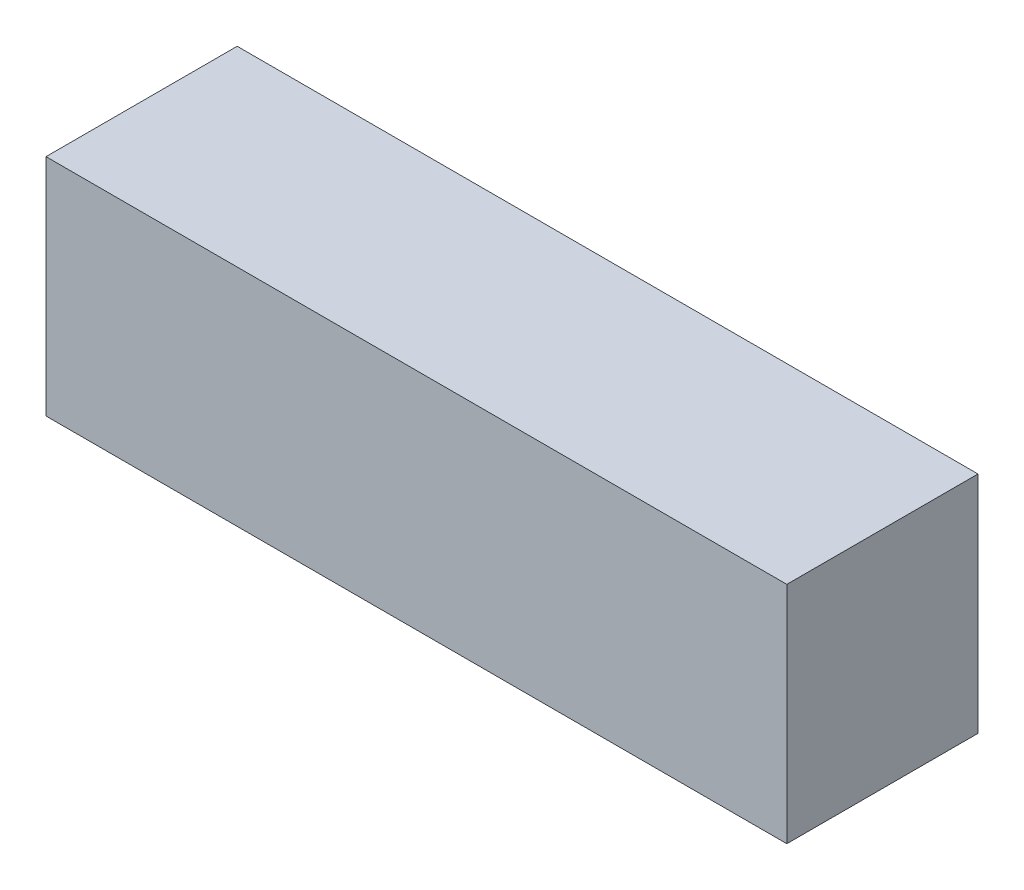
ISO-10303-21;
HEADER;
FILE_DESCRIPTION(('STEP AP214'),'2;1');
FILE_NAME('part.step','',(''),(''),'','','');
FILE_SCHEMA(('AUTOMOTIVE_DESIGN { 1 0 10303 214 1 1 1 1 }'));
ENDSEC;
DATA;
#1=APPLICATION_CONTEXT('core data for automotive mechanical design processes');
#2=APPLICATION_PROTOCOL_DEFINITION('international standard','automotive_design',2000,#1);
#3=PRODUCT_CONTEXT('',#1,'mechanical');
#4=PRODUCT('Part','Part','',(#3));
#5=PRODUCT_RELATED_PRODUCT_CATEGORY('part','',(#4));
#6=PRODUCT_DEFINITION_FORMATION('','',#4);
#7=PRODUCT_DEFINITION_CONTEXT('part definition',#1,'design');
#8=PRODUCT_DEFINITION('design','',#6,#7);
#9=PRODUCT_DEFINITION_SHAPE('','',#8);
#10=(LENGTH_UNIT() NAMED_UNIT(*) SI_UNIT(.MILLI.,.METRE.));
#11=(NAMED_UNIT(*) PLANE_ANGLE_UNIT() SI_UNIT($,.RADIAN.));
#12=(NAMED_UNIT(*) SI_UNIT($,.STERADIAN.) SOLID_ANGLE_UNIT());
#13=UNCERTAINTY_MEASURE_WITH_UNIT(LENGTH_MEASURE(1.E-05),#10,'distance_accuracy_value','');
#14=(GEOMETRIC_REPRESENTATION_CONTEXT(3) GLOBAL_UNCERTAINTY_ASSIGNED_CONTEXT((#13)) GLOBAL_UNIT_ASSIGNED_CONTEXT((#10,
#11,#12)) REPRESENTATION_CONTEXT('',''));
#15=CARTESIAN_POINT('',(0.,0.,0.));
#16=DIRECTION('',(0.,0.,1.));
#17=DIRECTION('',(1.,0.,0.));
#18=AXIS2_PLACEMENT_3D('',#15,#16,#17);
#19=CARTESIAN_POINT('',(-87.3046831314073,28.5620689655172,40.));
#20=DIRECTION('',(1.,0.,0.));
#21=DIRECTION('',(0.,1.,0.));
#22=AXIS2_PLACEMENT_3D('',#19,#20,#21);
#23=PLANE('',#22);
#24=DIRECTION('',(0.,-1.,0.));
#25=VECTOR('',#24,1.);
#26=CARTESIAN_POINT('',(-87.3046831314073,28.5620689655172,0.));
#27=LINE('',#26,#25);
#28=CARTESIAN_POINT('',(-87.3046831314073,28.5620689655172,0.));
#29=VERTEX_POINT('',#28);
#30=CARTESIAN_POINT('',(-87.3046831314073,-18.4379310344828,0.));
#31=VERTEX_POINT('',#30);
#32=EDGE_CURVE('E97',#29,#31,#27,.T.);
#33=ORIENTED_EDGE('',*,*,#32,.T.);
#34=DIRECTION('',(0.,0.,-1.));
#35=VECTOR('',#34,1.);
#36=CARTESIAN_POINT('',(-87.3046831314073,-18.4379310344828,40.));
#37=LINE('',#36,#35);
#38=CARTESIAN_POINT('',(-87.3046831314073,-18.4379310344828,40.));
#39=VERTEX_POINT('',#38);
#40=EDGE_CURVE('E11',#39,#31,#37,.T.);
#41=ORIENTED_EDGE('',*,*,#40,.F.);
#42=DIRECTION('',(0.,-1.,0.));
#43=VECTOR('',#42,1.);
#44=CARTESIAN_POINT('',(-87.3046831314073,28.5620689655172,40.));
#45=LINE('',#44,#43);
#46=CARTESIAN_POINT('',(-87.3046831314073,28.5620689655172,40.));
#47=VERTEX_POINT('',#46);
#48=EDGE_CURVE('E85',#47,#39,#45,.T.);
#49=ORIENTED_EDGE('',*,*,#48,.F.);
#50=DIRECTION('',(0.,0.,-1.));
#51=VECTOR('',#50,1.);
#52=CARTESIAN_POINT('',(-87.3046831314073,28.5620689655172,40.));
#53=LINE('',#52,#51);
#54=EDGE_CURVE('E93',#47,#29,#53,.T.);
#55=ORIENTED_EDGE('',*,*,#54,.T.);
#56=EDGE_LOOP('',(#33,#41,#49,#55));
#57=FACE_BOUND('',#56,.T.);
#58=ADVANCED_FACE('F34',(#57),#23,.F.);
#59=CARTESIAN_POINT('',(-87.3046831314073,-18.4379310344828,40.));
#60=DIRECTION('',(0.,1.,0.));
#61=DIRECTION('',(0.,0.,1.));
#62=AXIS2_PLACEMENT_3D('',#59,#60,#61);
#63=PLANE('',#62);
#64=DIRECTION('',(1.,0.,0.));
#65=VECTOR('',#64,1.);
#66=CARTESIAN_POINT('',(-87.3046831314073,-18.4379310344828,0.));
#67=LINE('',#66,#65);
#68=CARTESIAN_POINT('',(67.6953168685927,-18.4379310344828,0.));
#69=VERTEX_POINT('',#68);
#70=EDGE_CURVE('E89',#31,#69,#67,.T.);
#71=ORIENTED_EDGE('',*,*,#70,.T.);
#72=DIRECTION('',(0.,0.,-1.));
#73=VECTOR('',#72,1.);
#74=CARTESIAN_POINT('',(67.6953168685927,-18.4379310344828,40.));
#75=LINE('',#74,#73);
#76=CARTESIAN_POINT('',(67.6953168685927,-18.4379310344828,40.));
#77=VERTEX_POINT('',#76);
#78=EDGE_CURVE('E42',#77,#69,#75,.T.);
#79=ORIENTED_EDGE('',*,*,#78,.F.);
#80=DIRECTION('',(1.,0.,0.));
#81=VECTOR('',#80,1.);
#82=CARTESIAN_POINT('',(-87.3046831314073,-18.4379310344828,40.));
#83=LINE('',#82,#81);
#84=EDGE_CURVE('E80',#39,#77,#83,.T.);
#85=ORIENTED_EDGE('',*,*,#84,.F.);
#86=ORIENTED_EDGE('',*,*,#40,.T.);
#87=EDGE_LOOP('',(#71,#79,#85,#86));
#88=FACE_BOUND('',#87,.T.);
#89=ADVANCED_FACE('F88',(#88),#63,.F.);
#90=CARTESIAN_POINT('',(67.6953168685927,28.5620689655172,40.));
#91=DIRECTION('',(-1.,0.,0.));
#92=DIRECTION('',(0.,-1.,0.));
#93=AXIS2_PLACEMENT_3D('',#90,#91,#92);
#94=PLANE('',#93);
#95=DIRECTION('',(0.,1.,0.));
#96=VECTOR('',#95,1.);
#97=CARTESIAN_POINT('',(67.6953168685927,28.5620689655172,0.));
#98=LINE('',#97,#96);
#99=CARTESIAN_POINT('',(67.6953168685927,28.5620689655172,0.));
#100=VERTEX_POINT('',#99);
#101=EDGE_CURVE('E67',#69,#100,#98,.T.);
#102=ORIENTED_EDGE('',*,*,#101,.T.);
#103=DIRECTION('',(0.,0.,-1.));
#104=VECTOR('',#103,1.);
#105=CARTESIAN_POINT('',(67.6953168685927,28.5620689655172,40.));
#106=LINE('',#105,#104);
#107=CARTESIAN_POINT('',(67.6953168685927,28.5620689655172,40.));
#108=VERTEX_POINT('',#107);
#109=EDGE_CURVE('E90',#108,#100,#106,.T.);
#110=ORIENTED_EDGE('',*,*,#109,.F.);
#111=DIRECTION('',(0.,1.,0.));
#112=VECTOR('',#111,1.);
#113=CARTESIAN_POINT('',(67.6953168685927,28.5620689655172,40.));
#114=LINE('',#113,#112);
#115=EDGE_CURVE('E83',#77,#108,#114,.T.);
#116=ORIENTED_EDGE('',*,*,#115,.F.);
#117=ORIENTED_EDGE('',*,*,#78,.T.);
#118=EDGE_LOOP('',(#102,#110,#116,#117));
#119=FACE_BOUND('',#118,.T.);
#120=ADVANCED_FACE('F91',(#119),#94,.F.);
#121=CARTESIAN_POINT('',(-87.3046831314073,28.5620689655172,40.));
#122=DIRECTION('',(0.,-1.,0.));
#123=DIRECTION('',(0.,0.,-1.));
#124=AXIS2_PLACEMENT_3D('',#121,#122,#123);
#125=PLANE('',#124);
#126=DIRECTION('',(-1.,0.,0.));
#127=VECTOR('',#126,1.);
#128=CARTESIAN_POINT('',(-87.3046831314073,28.5620689655172,0.));
#129=LINE('',#128,#127);
#130=EDGE_CURVE('E73',#100,#29,#129,.T.);
#131=ORIENTED_EDGE('',*,*,#130,.T.);
#132=ORIENTED_EDGE('',*,*,#54,.F.);
#133=DIRECTION('',(-1.,0.,0.));
#134=VECTOR('',#133,1.);
#135=CARTESIAN_POINT('',(-87.3046831314073,28.5620689655172,40.));
#136=LINE('',#135,#134);
#137=EDGE_CURVE('E50',#108,#47,#136,.T.);
#138=ORIENTED_EDGE('',*,*,#137,.F.);
#139=ORIENTED_EDGE('',*,*,#109,.T.);
#140=EDGE_LOOP('',(#131,#132,#138,#139));
#141=FACE_BOUND('',#140,.T.);
#142=ADVANCED_FACE('F104',(#141),#125,.F.);
#143=CARTESIAN_POINT('',(0.,0.,40.));
#144=DIRECTION('',(0.,0.,1.));
#145=DIRECTION('',(1.,0.,0.));
#146=AXIS2_PLACEMENT_3D('',#143,#144,#145);
#147=PLANE('',#146);
#148=ORIENTED_EDGE('',*,*,#48,.T.);
#149=ORIENTED_EDGE('',*,*,#84,.T.);
#150=ORIENTED_EDGE('',*,*,#115,.T.);
#151=ORIENTED_EDGE('',*,*,#137,.T.);
#152=EDGE_LOOP('',(#148,#149,#150,#151));
#153=FACE_BOUND('',#152,.T.);
#154=ADVANCED_FACE('F81',(#153),#147,.T.);
#155=CARTESIAN_POINT('',(0.,0.,0.));
#156=DIRECTION('',(0.,0.,1.));
#157=DIRECTION('',(1.,0.,0.));
#158=AXIS2_PLACEMENT_3D('',#155,#156,#157);
#159=PLANE('',#158);
#160=ORIENTED_EDGE('',*,*,#32,.F.);
#161=ORIENTED_EDGE('',*,*,#130,.F.);
#162=ORIENTED_EDGE('',*,*,#101,.F.);
#163=ORIENTED_EDGE('',*,*,#70,.F.);
#164=EDGE_LOOP('',(#160,#161,#162,#163));
#165=FACE_BOUND('',#164,.T.);
#166=ADVANCED_FACE('F107',(#165),#159,.F.);
#167=CLOSED_SHELL('',(#58,#89,#120,#142,#154,#166));
#168=MANIFOLD_SOLID_BREP('B2',#167);
#169=ADVANCED_BREP_SHAPE_REPRESENTATION('',(#18,#168),#14);
#170=SHAPE_DEFINITION_REPRESENTATION(#9,#169);
ENDSEC;
END-ISO-10303-21;
